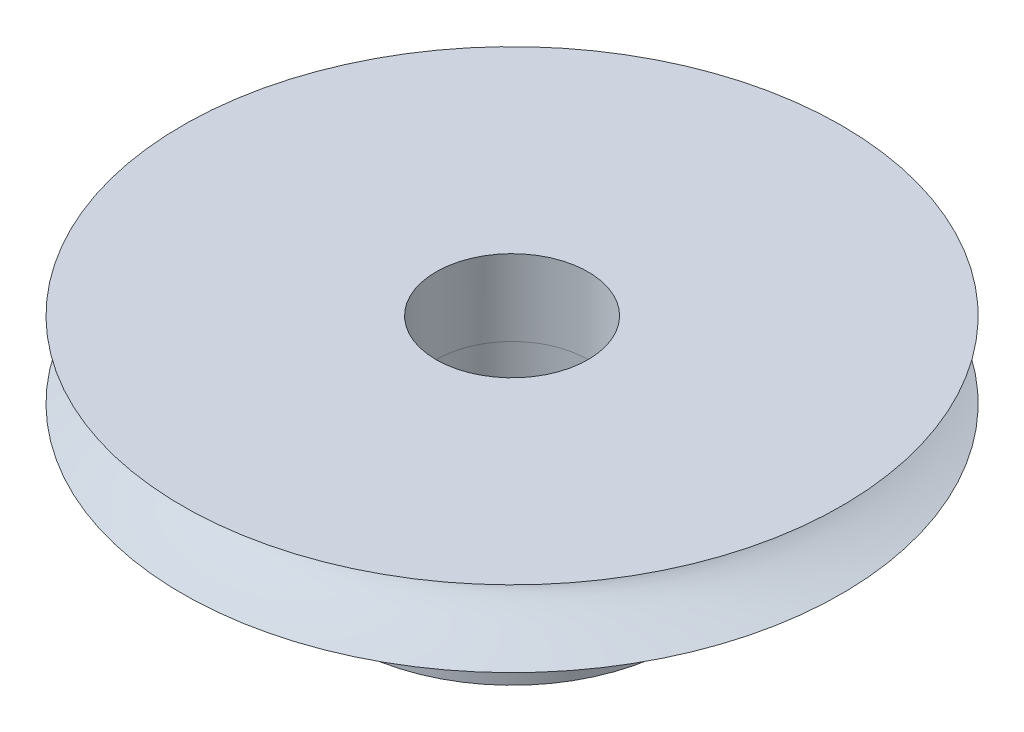
ISO-10303-21;
HEADER;
FILE_DESCRIPTION(('STEP AP214'),'2;1');
FILE_NAME('part.step','',(''),(''),'','','');
FILE_SCHEMA(('AUTOMOTIVE_DESIGN { 1 0 10303 214 1 1 1 1 }'));
ENDSEC;
DATA;
#1=APPLICATION_CONTEXT('core data for automotive mechanical design processes');
#2=APPLICATION_PROTOCOL_DEFINITION('international standard','automotive_design',2000,#1);
#3=PRODUCT_CONTEXT('',#1,'mechanical');
#4=PRODUCT('Part','Part','',(#3));
#5=PRODUCT_RELATED_PRODUCT_CATEGORY('part','',(#4));
#6=PRODUCT_DEFINITION_FORMATION('','',#4);
#7=PRODUCT_DEFINITION_CONTEXT('part definition',#1,'design');
#8=PRODUCT_DEFINITION('design','',#6,#7);
#9=PRODUCT_DEFINITION_SHAPE('','',#8);
#10=(LENGTH_UNIT() NAMED_UNIT(*) SI_UNIT(.MILLI.,.METRE.));
#11=(NAMED_UNIT(*) PLANE_ANGLE_UNIT() SI_UNIT($,.RADIAN.));
#12=(NAMED_UNIT(*) SI_UNIT($,.STERADIAN.) SOLID_ANGLE_UNIT());
#13=UNCERTAINTY_MEASURE_WITH_UNIT(LENGTH_MEASURE(1.E-05),#10,'distance_accuracy_value','');
#14=(GEOMETRIC_REPRESENTATION_CONTEXT(3) GLOBAL_UNCERTAINTY_ASSIGNED_CONTEXT((#13)) GLOBAL_UNIT_ASSIGNED_CONTEXT((#10,
#11,#12)) REPRESENTATION_CONTEXT('',''));
#15=CARTESIAN_POINT('',(0.,0.,0.));
#16=DIRECTION('',(0.,0.,1.));
#17=DIRECTION('',(1.,0.,0.));
#18=AXIS2_PLACEMENT_3D('',#15,#16,#17);
#19=CARTESIAN_POINT('',(-4.7030891410279,0.0646365379077759,0.));
#20=CARTESIAN_POINT('',(0.132127884853617,-1.29416630680979,0.));
#21=CARTESIAN_POINT('',(-4.7030891410279,-2.93536346209222,0.));
#22=B_SPLINE_CURVE_WITH_KNOTS('',2,(#19,#20,#21),.UNSPECIFIED.,.F.,.F.,(3,3),(0.,1.),.UNSPECIFIED.);
#23=CARTESIAN_POINT('',(8.2969108589721,-2.93536346209222,0.));
#24=DIRECTION('',(0.,-1.,0.));
#25=AXIS1_PLACEMENT('',#23,#24);
#26=SURFACE_OF_REVOLUTION('',#22,#25);
#27=CARTESIAN_POINT('',(8.2969108589721,-2.93536346209222,0.));
#28=DIRECTION('',(0.,-1.,0.));
#29=DIRECTION('',(0.,0.,-1.));
#30=AXIS2_PLACEMENT_3D('',#27,#28,#29);
#31=CIRCLE('',#30,13.);
#32=CARTESIAN_POINT('',(8.2969108589721,-2.93536346209222,-13.));
#33=VERTEX_POINT('',#32);
#34=EDGE_CURVE('E83',#33,#33,#31,.T.);
#35=ORIENTED_EDGE('',*,*,#34,.F.);
#36=EDGE_LOOP('',(#35));
#37=FACE_BOUND('',#36,.T.);
#38=CARTESIAN_POINT('',(8.2969108589721,0.0646365379077759,0.));
#39=DIRECTION('',(0.,-1.,0.));
#40=DIRECTION('',(0.,0.,-1.));
#41=AXIS2_PLACEMENT_3D('',#38,#39,#40);
#42=CIRCLE('',#41,13.);
#43=CARTESIAN_POINT('',(8.2969108589721,0.0646365379077759,-13.));
#44=VERTEX_POINT('',#43);
#45=EDGE_CURVE('E72',#44,#44,#42,.T.);
#46=ORIENTED_EDGE('',*,*,#45,.T.);
#47=EDGE_LOOP('',(#46));
#48=FACE_BOUND('',#47,.T.);
#49=ADVANCED_FACE('F36',(#37,#48),#26,.T.);
#50=CARTESIAN_POINT('',(-4.7030891410279,-2.93536346209222,0.));
#51=DIRECTION('',(0.,1.,0.));
#52=DIRECTION('',(0.,0.,1.));
#53=AXIS2_PLACEMENT_3D('',#50,#51,#52);
#54=PLANE('',#53);
#55=CARTESIAN_POINT('',(8.29691086,-2.93536346209222,0.));
#56=DIRECTION('',(0.,1.,0.));
#57=DIRECTION('',(0.,0.,1.));
#58=AXIS2_PLACEMENT_3D('',#55,#56,#57);
#59=CIRCLE('',#58,6.53976727896577);
#60=CARTESIAN_POINT('',(8.29691086,-2.93536346209222,6.53976727896577));
#61=VERTEX_POINT('',#60);
#62=EDGE_CURVE('E48',#61,#61,#59,.F.);
#63=ORIENTED_EDGE('',*,*,#62,.F.);
#64=EDGE_LOOP('',(#63));
#65=FACE_BOUND('',#64,.T.);
#66=ORIENTED_EDGE('',*,*,#34,.T.);
#67=EDGE_LOOP('',(#66));
#68=FACE_BOUND('',#67,.T.);
#69=ADVANCED_FACE('F124',(#65,#68),#54,.F.);
#70=CARTESIAN_POINT('',(-4.7030891410279,0.0646365379077759,0.));
#71=DIRECTION('',(0.,1.,0.));
#72=DIRECTION('',(0.,0.,1.));
#73=AXIS2_PLACEMENT_3D('',#70,#71,#72);
#74=PLANE('',#73);
#75=CARTESIAN_POINT('',(8.29691086,0.0646365379077759,0.));
#76=DIRECTION('',(0.,1.,0.));
#77=DIRECTION('',(0.,0.,1.));
#78=AXIS2_PLACEMENT_3D('',#75,#76,#77);
#79=CIRCLE('',#78,3.);
#80=CARTESIAN_POINT('',(8.29691086,0.0646365379077759,3.));
#81=VERTEX_POINT('',#80);
#82=EDGE_CURVE('E70',#81,#81,#79,.T.);
#83=ORIENTED_EDGE('',*,*,#82,.F.);
#84=EDGE_LOOP('',(#83));
#85=FACE_BOUND('',#84,.T.);
#86=ORIENTED_EDGE('',*,*,#45,.F.);
#87=EDGE_LOOP('',(#86));
#88=FACE_BOUND('',#87,.T.);
#89=ADVANCED_FACE('F129',(#85,#88),#74,.T.);
#90=CARTESIAN_POINT('',(8.29691086,-2.93536346209222,0.));
#91=DIRECTION('',(0.,1.,0.));
#92=DIRECTION('',(0.,0.,1.));
#93=AXIS2_PLACEMENT_3D('',#90,#91,#92);
#94=CYLINDRICAL_SURFACE('',#93,3.);
#95=CARTESIAN_POINT('',(8.29691086,-2.93536346209222,0.));
#96=DIRECTION('',(0.,1.,0.));
#97=DIRECTION('',(0.,0.,1.));
#98=AXIS2_PLACEMENT_3D('',#95,#96,#97);
#99=CIRCLE('',#98,3.);
#100=CARTESIAN_POINT('',(5.29691086,-2.93536346209222,0.));
#101=VERTEX_POINT('',#100);
#102=EDGE_CURVE('E56',#101,#101,#99,.T.);
#103=ORIENTED_EDGE('',*,*,#102,.F.);
#104=EDGE_LOOP('',(#103));
#105=FACE_BOUND('',#104,.T.);
#106=ORIENTED_EDGE('',*,*,#82,.T.);
#107=EDGE_LOOP('',(#106));
#108=FACE_BOUND('',#107,.T.);
#109=ADVANCED_FACE('F120',(#105,#108),#94,.F.);
#110=CARTESIAN_POINT('',(8.29691086,-7.93536346209222,0.));
#111=DIRECTION('',(0.,1.,0.));
#112=DIRECTION('',(0.,0.,1.));
#113=AXIS2_PLACEMENT_3D('',#110,#111,#112);
#114=CYLINDRICAL_SURFACE('',#113,6.53976727896577);
#115=CARTESIAN_POINT('',(14.6232276632152,-5.43164949076936,1.65718790980036));
#116=CARTESIAN_POINT('',(14.6232285423907,-5.38689388208723,1.65718610338816));
#117=CARTESIAN_POINT('',(14.6241932172446,-5.34211011048688,1.65351536227793));
#118=CARTESIAN_POINT('',(14.6279879225404,-5.25378835530042,1.63892462455044));
#119=CARTESIAN_POINT('',(14.6308199146819,-5.21025173214282,1.62799700417297));
#120=CARTESIAN_POINT('',(14.6381507130368,-5.1257158485961,1.59920370558382));
#121=CARTESIAN_POINT('',(14.642648402077,-5.08471490899901,1.58134267718221));
#122=CARTESIAN_POINT('',(14.6530073040293,-5.0063739620068,1.53917613265695));
#123=CARTESIAN_POINT('',(14.6588682794177,-4.96903331849192,1.51487173904977));
#124=CARTESIAN_POINT('',(14.6716068562294,-4.89886477627407,1.46033985308055));
#125=CARTESIAN_POINT('',(14.6784891935206,-4.86605935393636,1.43008454254686));
#126=CARTESIAN_POINT('',(14.6928249730675,-4.80608656379418,1.36453726206844));
#127=CARTESIAN_POINT('',(14.7002784434357,-4.77891947376611,1.32924504412141));
#128=CARTESIAN_POINT('',(14.7153491757765,-4.73091419341167,1.2544572869117));
#129=CARTESIAN_POINT('',(14.72296688137,-4.71009629970239,1.21494880164004));
#130=CARTESIAN_POINT('',(14.7379360486431,-4.67551033759991,1.13291094451407));
#131=CARTESIAN_POINT('',(14.7452875197957,-4.66174201814593,1.09038168030203));
#132=CARTESIAN_POINT('',(14.7593425038368,-4.64171306797088,1.00371794896085));
#133=CARTESIAN_POINT('',(14.7660490831124,-4.63541510978355,0.959592607799138));
#134=CARTESIAN_POINT('',(14.7785994402972,-4.63038999645085,0.870792422805709));
#135=CARTESIAN_POINT('',(14.7844432507854,-4.63166255535966,0.826117599792069));
#136=CARTESIAN_POINT('',(14.7950849286729,-4.64171239317647,0.737740465696337));
#137=CARTESIAN_POINT('',(14.7998882190077,-4.65044952818574,0.694034233195488));
#138=CARTESIAN_POINT('',(14.8084401951434,-4.67511777493138,0.608593787501458));
#139=CARTESIAN_POINT('',(14.8121888616132,-4.69104901852023,0.566859610467281));
#140=CARTESIAN_POINT('',(14.818686810666,-4.72969609794835,0.486444010430453));
#141=CARTESIAN_POINT('',(14.8214334868195,-4.75242935216511,0.44777075117003));
#142=CARTESIAN_POINT('',(14.8260382059198,-4.8040224711038,0.374693012350333));
#143=CARTESIAN_POINT('',(14.8278962098182,-4.83288260496094,0.340288720419042));
#144=CARTESIAN_POINT('',(14.830908169946,-4.89613519918013,0.276519536058027));
#145=CARTESIAN_POINT('',(14.8320574378078,-4.93056263788654,0.247189106186187));
#146=CARTESIAN_POINT('',(14.8338320988496,-5.00385228459629,0.194701435202917));
#147=CARTESIAN_POINT('',(14.8344574905101,-5.04271450546203,0.171544211996561));
#148=CARTESIAN_POINT('',(14.835374044976,-5.12380105148705,0.132086417340071));
#149=CARTESIAN_POINT('',(14.8356650753751,-5.16602670148361,0.115788563802393));
#150=CARTESIAN_POINT('',(14.8360633118534,-5.25262571324516,0.0905641895641914));
#151=CARTESIAN_POINT('',(14.8361705264048,-5.29699897592803,0.0816373291385821));
#152=CARTESIAN_POINT('',(14.8362896290041,-5.38632666118881,0.0714669594083169));
#153=CARTESIAN_POINT('',(14.8363021284823,-5.43127547653657,0.0701741805181361));
#154=CARTESIAN_POINT('',(14.8362464508406,-5.52074740301057,0.0751805424654309));
#155=CARTESIAN_POINT('',(14.8361782753658,-5.56527052279879,0.0814795284940992));
#156=CARTESIAN_POINT('',(14.8358988536232,-5.65248110194662,0.10144044943636));
#157=CARTESIAN_POINT('',(14.8356880686569,-5.69517400949202,0.115078615158611));
#158=CARTESIAN_POINT('',(14.8349962093295,-5.77768258333974,0.149288353446227));
#159=CARTESIAN_POINT('',(14.8345151258527,-5.81749815255307,0.169860159838414));
#160=CARTESIAN_POINT('',(14.8331054192907,-5.89334332008084,0.217449179952169));
#161=CARTESIAN_POINT('',(14.8321745429946,-5.9293527327057,0.244498494502588));
#162=CARTESIAN_POINT('',(14.8296675182739,-5.99635760013778,0.304198701990065));
#163=CARTESIAN_POINT('',(14.8280913458281,-6.02735286823351,0.336849803427388));
#164=CARTESIAN_POINT('',(14.8240954174176,-6.08362105686695,0.407009497784259));
#165=CARTESIAN_POINT('',(14.8216711099469,-6.10886186416613,0.444543598526803));
#166=CARTESIAN_POINT('',(14.8158312504636,-6.15268257787918,0.523247496623109));
#167=CARTESIAN_POINT('',(14.8124157177072,-6.17126261367381,0.564417223338058));
#168=CARTESIAN_POINT('',(14.804524556844,-6.20118117293371,0.649093133566165));
#169=CARTESIAN_POINT('',(14.8000517012225,-6.21253835331013,0.692592980196058));
#170=CARTESIAN_POINT('',(14.7900553801637,-6.22774953022037,0.780767484098668));
#171=CARTESIAN_POINT('',(14.7845319600101,-6.2316038500773,0.825442090662999));
#172=CARTESIAN_POINT('',(14.7725932641062,-6.23169403092554,0.914381634596473));
#173=CARTESIAN_POINT('',(14.7661840440878,-6.22797944776823,0.958647342789999));
#174=CARTESIAN_POINT('',(14.7526669105414,-6.21314210098296,1.04580857745071));
#175=CARTESIAN_POINT('',(14.7455589973586,-6.20201934101534,1.08870410459488));
#176=CARTESIAN_POINT('',(14.7309572839263,-6.17269672960967,1.17191640578135));
#177=CARTESIAN_POINT('',(14.723463608032,-6.15449914658373,1.21223400156988));
#178=CARTESIAN_POINT('',(14.7084659455005,-6.11154858667805,1.2892078841463));
#179=CARTESIAN_POINT('',(14.7009619587625,-6.08679554525455,1.32586413488042));
#180=CARTESIAN_POINT('',(14.6863141325435,-6.03125302080083,1.39475152648839));
#181=CARTESIAN_POINT('',(14.6791728472817,-6.00042664862577,1.4269534691128));
#182=CARTESIAN_POINT('',(14.6657308394642,-5.9336888633646,1.48580002728916));
#183=CARTESIAN_POINT('',(14.6594303166723,-5.89777624595848,1.51244332296023));
#184=CARTESIAN_POINT('',(14.6480534605966,-5.82173354753015,1.55953020684399));
#185=CARTESIAN_POINT('',(14.6429817445171,-5.78158834903103,1.57995048409934));
#186=CARTESIAN_POINT('',(14.6344397952977,-5.69835031402823,1.61387478872132));
#187=CARTESIAN_POINT('',(14.6309678131482,-5.65526075612353,1.62738637123598));
#188=CARTESIAN_POINT('',(14.626702664487,-5.58189625962208,1.64387832601437));
#189=CARTESIAN_POINT('',(14.6254035894691,-5.55208487697699,1.64886257883413));
#190=CARTESIAN_POINT('',(14.6236657951211,-5.49206977036485,1.65551796868654));
#191=CARTESIAN_POINT('',(14.6232270696436,-5.46186604920267,1.65718912939186));
#192=CARTESIAN_POINT('',(14.6232276632152,-5.43164949076936,1.65718790980036));
#193=B_SPLINE_CURVE_WITH_KNOTS('',3,(#115,#116,#117,#118,#119,#120,#121,#122,#123,#124,#125,
#126,#127,#128,#129,#130,#131,#132,#133,#134,#135,#136,#137,#138,#139,#140,#141,#142,#143,#144,
#145,#146,#147,#148,#149,#150,#151,#152,#153,#154,#155,#156,#157,#158,#159,#160,#161,#162,#163,
#164,#165,#166,#167,#168,#169,#170,#171,#172,#173,#174,#175,#176,#177,#178,#179,#180,#181,#182,
#183,#184,#185,#186,#187,#188,#189,#190,#191,#192),.UNSPECIFIED.,.T.,.F.,(4,2,2,2,2,2,2,2,2,2,2,
2,2,2,2,2,2,2,2,2,2,2,2,2,2,2,2,2,2,2,2,2,2,2,2,2,2,2,4),(0.,0.134156444816222,
0.268454051962342,0.402661749135058,0.536846080960288,0.671673254094057,0.806507068006988,
0.941767496346315,1.07702310723883,1.21159999492362,1.34617179953998,1.48002441067543,
1.6138794751396,1.74808028857725,1.8822869982689,2.01737223537042,2.15245786427561,
2.28759696836332,2.42272984361512,2.55698962354853,2.69124666574639,2.82507148757523,
2.95890082290074,3.09340763033806,3.22791944524748,3.36316447844813,3.49840688446776,
3.63329851994902,3.76818434237438,3.90218986536058,4.0361953221355,4.17015784790922,
4.3041216927006,4.43892581295428,4.57376190562698,4.70909704556757,4.84428386868606,
4.93485966775244,5.02543481963532),.UNSPECIFIED.);
#194=CARTESIAN_POINT('',(14.6232276632152,-5.43164949076936,1.65718790980036));
#195=VERTEX_POINT('',#194);
#196=EDGE_CURVE('E40',#195,#195,#193,.T.);
#197=ORIENTED_EDGE('',*,*,#196,.T.);
#198=EDGE_LOOP('',(#197));
#199=FACE_BOUND('',#198,.T.);
#200=CARTESIAN_POINT('',(1.75753376509114,-5.43164949076936,-0.0714372004820922));
#201=CARTESIAN_POINT('',(1.75753339390409,-5.47640509945149,-0.0714391748920874));
#202=CARTESIAN_POINT('',(1.7575718359038,-5.52118887105184,-0.0752343639631053));
#203=CARTESIAN_POINT('',(1.75776298493084,-5.6095106262383,-0.090309272843873));
#204=CARTESIAN_POINT('',(1.75791581214776,-5.6530472493959,-0.101596863837775));
#205=CARTESIAN_POINT('',(1.75844509020798,-5.73758313294262,-0.131304009659915));
#206=CARTESIAN_POINT('',(1.75882139127056,-5.77858407253971,-0.149718784699975));
#207=CARTESIAN_POINT('',(1.75995987158675,-5.85692501953192,-0.193124178252256));
#208=CARTESIAN_POINT('',(1.76072198364819,-5.8942656630468,-0.218113651362388));
#209=CARTESIAN_POINT('',(1.76282905875174,-5.96443420526465,-0.274073978032768));
#210=CARTESIAN_POINT('',(1.76417679658596,-5.99723962760236,-0.305072913253345));
#211=CARTESIAN_POINT('',(1.76765086529169,-6.05721241774454,-0.372079565161665));
#212=CARTESIAN_POINT('',(1.76977723450876,-6.08437950777261,-0.408087528476787));
#213=CARTESIAN_POINT('',(1.77498147160936,-6.13238478812706,-0.484200940684797));
#214=CARTESIAN_POINT('',(1.77806232874947,-6.15320268183633,-0.524318993556941));
#215=CARTESIAN_POINT('',(1.78527821836391,-6.18778864393881,-0.607398575330946));
#216=CARTESIAN_POINT('',(1.78941321328874,-6.20155696339279,-0.650360002908436));
#217=CARTESIAN_POINT('',(1.79873188078588,-6.22158591356784,-0.737660102235137));
#218=CARTESIAN_POINT('',(1.80391018688819,-6.22788387175517,-0.781990781049342));
#219=CARTESIAN_POINT('',(1.81524404471924,-6.23290898508787,-0.870954413995605));
#220=CARTESIAN_POINT('',(1.8213995595293,-6.23163642617906,-0.915587356647258));
#221=CARTESIAN_POINT('',(1.83446274033532,-6.22158658836225,-1.00363913940301));
#222=CARTESIAN_POINT('',(1.84136621079027,-6.21284945335298,-1.04706319325725));
#223=CARTESIAN_POINT('',(1.85566983366377,-6.18818120660734,-1.13173085195236));
#224=CARTESIAN_POINT('',(1.86306999518348,-6.17224996301849,-1.1729744168141));
#225=CARTESIAN_POINT('',(1.87802847418032,-6.13360288359037,-1.25225326630926));
#226=CARTESIAN_POINT('',(1.88558715080243,-6.11086962937361,-1.29027998874807));
#227=CARTESIAN_POINT('',(1.90043486279376,-6.05927651043492,-1.36198148662375));
#228=CARTESIAN_POINT('',(1.9077238863014,-6.03041637657778,-1.39565607077983));
#229=CARTESIAN_POINT('',(1.92165084496759,-5.9671637823586,-1.4579587240154));
#230=CARTESIAN_POINT('',(1.92828420570907,-5.93273634365218,-1.48655231522669));
#231=CARTESIAN_POINT('',(1.94042678795012,-5.85944669694243,-1.53764695999089));
#232=CARTESIAN_POINT('',(1.94593600618917,-5.8205844760767,-1.56014799587266));
#233=CARTESIAN_POINT('',(1.95546698084669,-5.73949793005167,-1.59844836340772));
#234=CARTESIAN_POINT('',(1.95948814757316,-5.69727228005511,-1.61424503858912));
#235=CARTESIAN_POINT('',(1.96576209682292,-5.61067326829357,-1.63867995640795));
#236=CARTESIAN_POINT('',(1.96801496084608,-5.5663000056107,-1.64731852895852));
#237=CARTESIAN_POINT('',(1.97058458708726,-5.47697232034991,-1.65715964814589));
#238=CARTESIAN_POINT('',(1.97091376443987,-5.43202350500215,-1.65840987843123));
#239=CARTESIAN_POINT('',(1.96964602062585,-5.34255157852815,-1.6535663687978));
#240=CARTESIAN_POINT('',(1.96804913873479,-5.29802845873993,-1.64747277863184));
#241=CARTESIAN_POINT('',(1.96304989550388,-5.2108178795921,-1.62814600941162));
#242=CARTESIAN_POINT('',(1.95965336318417,-5.1681249720467,-1.614935878346));
#243=CARTESIAN_POINT('',(1.95129090507569,-5.08561639819898,-1.58175675603362));
#244=CARTESIAN_POINT('',(1.94632492635999,-5.04580082898565,-1.56178753684647));
#245=CARTESIAN_POINT('',(1.93512334875583,-4.96995566145788,-1.515514145279));
#246=CARTESIAN_POINT('',(1.92888145004226,-4.93394624883302,-1.48917841576992));
#247=CARTESIAN_POINT('',(1.9155414840795,-4.86694138140094,-1.43093371425029));
#248=CARTESIAN_POINT('',(1.9084433849652,-4.83594611330521,-1.39902453479339));
#249=CARTESIAN_POINT('',(1.89377870091691,-4.77967792467177,-1.33029828654808));
#250=CARTESIAN_POINT('',(1.8862097731917,-4.75443711737259,-1.29345541317541));
#251=CARTESIAN_POINT('',(1.87106835326513,-4.71061640365954,-1.21600126585621));
#252=CARTESIAN_POINT('',(1.86349586113587,-4.69203636786491,-1.17539006512604));
#253=CARTESIAN_POINT('',(1.84875666036845,-4.66211780860501,-1.09163425247125));
#254=CARTESIAN_POINT('',(1.84158895021275,-4.6507606282286,-1.04849648450211));
#255=CARTESIAN_POINT('',(1.82795678485292,-4.63554945131835,-0.96081048994891));
#256=CARTESIAN_POINT('',(1.82149229935585,-4.63169513146142,-0.916262324227641));
#257=CARTESIAN_POINT('',(1.80953168828338,-4.63160495061318,-0.827325724800008));
#258=CARTESIAN_POINT('',(1.80402951827851,-4.63531953377049,-0.782938146037969));
#259=CARTESIAN_POINT('',(1.79406075718562,-4.65015688055576,-0.695300154680545));
#260=CARTESIAN_POINT('',(1.78959416558592,-4.66127964052338,-0.652049741523305));
#261=CARTESIAN_POINT('',(1.78171385508749,-4.69060225192905,-0.567934357613135));
#262=CARTESIAN_POINT('',(1.77829979934093,-4.70879983495499,-0.527068627080866));
#263=CARTESIAN_POINT('',(1.77244804833165,-4.75175039486067,-0.448865906601185));
#264=CARTESIAN_POINT('',(1.77001036268266,-4.77650343628417,-0.41152895140231));
#265=CARTESIAN_POINT('',(1.76595563994075,-4.83204596073789,-0.341218278251094));
#266=CARTESIAN_POINT('',(1.76434384619378,-4.86287233291295,-0.308273397239116));
#267=CARTESIAN_POINT('',(1.76177638226976,-4.92961011817412,-0.24796574339345));
#268=CARTESIAN_POINT('',(1.76082086780073,-4.96552273558024,-0.220604296359939));
#269=CARTESIAN_POINT('',(1.75936549936706,-5.04156543400857,-0.172184368739466));
#270=CARTESIAN_POINT('',(1.75886734495484,-5.08171063250768,-0.151149591123377));
#271=CARTESIAN_POINT('',(1.75815191766239,-5.16494866751048,-0.116173720807695));
#272=CARTESIAN_POINT('',(1.75793433755607,-5.20803822541519,-0.102224879243078));
#273=CARTESIAN_POINT('',(1.7576951148712,-5.28140272191664,-0.0851920040300962));
#274=CARTESIAN_POINT('',(1.75763250762501,-5.31121410456173,-0.0800416203156364));
#275=CARTESIAN_POINT('',(1.75755195819723,-5.37122921117388,-0.0731635642622601));
#276=CARTESIAN_POINT('',(1.7575340156965,-5.40143293233605,-0.0714358674675998));
#277=CARTESIAN_POINT('',(1.75753376509114,-5.43164949076936,-0.0714372004820922));
#278=B_SPLINE_CURVE_WITH_KNOTS('',3,(#200,#201,#202,#203,#204,#205,#206,#207,#208,#209,#210,
#211,#212,#213,#214,#215,#216,#217,#218,#219,#220,#221,#222,#223,#224,#225,#226,#227,#228,#229,
#230,#231,#232,#233,#234,#235,#236,#237,#238,#239,#240,#241,#242,#243,#244,#245,#246,#247,#248,
#249,#250,#251,#252,#253,#254,#255,#256,#257,#258,#259,#260,#261,#262,#263,#264,#265,#266,#267,
#268,#269,#270,#271,#272,#273,#274,#275,#276,#277),.UNSPECIFIED.,.T.,.F.,(4,2,2,2,2,2,2,2,2,2,2,
2,2,2,2,2,2,2,2,2,2,2,2,2,2,2,2,2,2,2,2,2,2,2,2,2,2,2,4),(0.,0.134156444816222,
0.268454051962342,0.402661749135058,0.536846080960288,0.671673254094056,0.806507068006987,
0.941767496346315,1.07702310723883,1.21159999492362,1.34617179953998,1.48002441067543,
1.6138794751396,1.74808028857725,1.8822869982689,2.01737223537042,2.15245786427561,
2.28759696836332,2.42272984361512,2.55698962354853,2.69124666574639,2.82507148757523,
2.95890082290074,3.09340763033806,3.22791944524748,3.36316447844813,3.49840688446776,
3.63329851994902,3.76818434237438,3.90218986536058,4.0361953221355,4.17015784790922,
4.30412169270059,4.43892581295428,4.57376190562698,4.70909704556756,4.84428386868606,
4.93485966775244,5.02543481963532),.UNSPECIFIED.);
#279=CARTESIAN_POINT('',(1.75753376509114,-5.43164949076936,-0.0714372004820922));
#280=VERTEX_POINT('',#279);
#281=EDGE_CURVE('E11',#280,#280,#278,.T.);
#282=ORIENTED_EDGE('',*,*,#281,.T.);
#283=EDGE_LOOP('',(#282));
#284=FACE_BOUND('',#283,.T.);
#285=CARTESIAN_POINT('',(8.29691086,-7.93536346209222,0.));
#286=DIRECTION('',(0.,-1.,0.));
#287=DIRECTION('',(0.,0.,-1.));
#288=AXIS2_PLACEMENT_3D('',#285,#286,#287);
#289=CIRCLE('',#288,6.53976727896577);
#290=CARTESIAN_POINT('',(8.29691086,-7.93536346209222,-6.53976727896577));
#291=VERTEX_POINT('',#290);
#292=EDGE_CURVE('E62',#291,#291,#289,.T.);
#293=ORIENTED_EDGE('',*,*,#292,.F.);
#294=EDGE_LOOP('',(#293));
#295=FACE_BOUND('',#294,.T.);
#296=ORIENTED_EDGE('',*,*,#62,.T.);
#297=EDGE_LOOP('',(#296));
#298=FACE_BOUND('',#297,.T.);
#299=ADVANCED_FACE('F89',(#199,#284,#295,#298),#114,.T.);
#300=CARTESIAN_POINT('',(8.29691086,-7.93536346209222,0.));
#301=DIRECTION('',(0.,-1.,0.));
#302=DIRECTION('',(0.,0.,-1.));
#303=AXIS2_PLACEMENT_3D('',#300,#301,#302);
#304=PLANE('',#303);
#305=CARTESIAN_POINT('',(8.33295715963622,-7.93536346209222,0.));
#306=DIRECTION('',(0.,1.,0.));
#307=DIRECTION('',(0.,0.,1.));
#308=AXIS2_PLACEMENT_3D('',#305,#306,#307);
#309=CIRCLE('',#308,3.03604629963622);
#310=CARTESIAN_POINT('',(8.33295715963622,-7.93536346209222,3.03604629963622));
#311=VERTEX_POINT('',#310);
#312=EDGE_CURVE('E58',#311,#311,#309,.T.);
#313=ORIENTED_EDGE('',*,*,#312,.T.);
#314=EDGE_LOOP('',(#313));
#315=FACE_BOUND('',#314,.T.);
#316=ORIENTED_EDGE('',*,*,#292,.T.);
#317=EDGE_LOOP('',(#316));
#318=FACE_BOUND('',#317,.T.);
#319=ADVANCED_FACE('F112',(#315,#318),#304,.T.);
#320=CARTESIAN_POINT('',(8.33295715963622,-7.93536346209222,0.));
#321=DIRECTION('',(0.,1.,0.));
#322=DIRECTION('',(0.,0.,1.));
#323=AXIS2_PLACEMENT_3D('',#320,#321,#322);
#324=CYLINDRICAL_SURFACE('',#323,3.03604629963622);
#325=CARTESIAN_POINT('',(11.1271513854245,-5.43164949076936,1.18745768855415));
#326=CARTESIAN_POINT('',(11.127152309663,-5.47572827349108,1.1874567002764));
#327=CARTESIAN_POINT('',(11.1286415742665,-5.5198188155438,1.18396961262573));
#328=CARTESIAN_POINT('',(11.1344625677126,-5.60672758635231,1.17012780231858));
#329=CARTESIAN_POINT('',(11.1387957681645,-5.64954514439908,1.15976952409932));
#330=CARTESIAN_POINT('',(11.1499056896066,-5.7326377980739,1.13251608950444));
#331=CARTESIAN_POINT('',(11.1566789983855,-5.77291635224591,1.11563005904317));
#332=CARTESIAN_POINT('',(11.1720994898839,-5.84994847641541,1.07577997508151));
#333=CARTESIAN_POINT('',(11.1807468076178,-5.88670179215899,1.05281548362727));
#334=CARTESIAN_POINT('',(11.1994476228411,-5.95654796147817,1.00079393139586));
#335=CARTESIAN_POINT('',(11.2095281828102,-5.98954088426522,0.971612402019973));
#336=CARTESIAN_POINT('',(11.2301805519691,-6.05004717110189,0.908176570597557));
#337=CARTESIAN_POINT('',(11.2407524120683,-6.07755996572252,0.873921742038919));
#338=CARTESIAN_POINT('',(11.2618042600932,-6.1267466083819,0.800567693862461));
#339=CARTESIAN_POINT('',(11.2722800712872,-6.1483199840529,0.761399729906443));
#340=CARTESIAN_POINT('',(11.2922423739491,-6.18436169763989,0.679686912808865));
#341=CARTESIAN_POINT('',(11.3017290271325,-6.19883119839373,0.637142613667108));
#342=CARTESIAN_POINT('',(11.3189292227043,-6.21993441064326,0.55085329095033));
#343=CARTESIAN_POINT('',(11.3266776258958,-6.2267358673949,0.507156287759459));
#344=CARTESIAN_POINT('',(11.3402887248185,-6.2328358853779,0.418955503829959));
#345=CARTESIAN_POINT('',(11.3461517326075,-6.23213568889086,0.374451857890764));
#346=CARTESIAN_POINT('',(11.3557118872382,-6.22337088545738,0.287080998021992));
#347=CARTESIAN_POINT('',(11.3594593730767,-6.21549026093456,0.244200643338408));
#348=CARTESIAN_POINT('',(11.3650688524295,-6.19288380002708,0.160158194417335));
#349=CARTESIAN_POINT('',(11.3669307432251,-6.17815759079025,0.118996193904964));
#350=CARTESIAN_POINT('',(11.3690165402118,-6.14214348558359,0.0391446224948176));
#351=CARTESIAN_POINT('',(11.3692248832816,-6.1207952051462,0.000481932516067441));
#352=CARTESIAN_POINT('',(11.3683499786866,-6.0721891702916,-0.0729166581368415));
#353=CARTESIAN_POINT('',(11.3672664860322,-6.04493029576426,-0.107651812607159));
#354=CARTESIAN_POINT('',(11.364239889403,-5.98431565418134,-0.173244194719558));
#355=CARTESIAN_POINT('',(11.3622720892371,-5.95080217073004,-0.203954699896976));
#356=CARTESIAN_POINT('',(11.3580337643043,-5.87913002588671,-0.259350474510941));
#357=CARTESIAN_POINT('',(11.3557632216918,-5.84097109067246,-0.284035388516141));
#358=CARTESIAN_POINT('',(11.3514481007048,-5.76076465618594,-0.326733878925921));
#359=CARTESIAN_POINT('',(11.3494049907042,-5.71869478231129,-0.344705690343094));
#360=CARTESIAN_POINT('',(11.3460230880388,-5.63205916875437,-0.373119054122296));
#361=CARTESIAN_POINT('',(11.3446841278893,-5.5874940253738,-0.383562397376833));
#362=CARTESIAN_POINT('',(11.3430303050189,-5.49850793783274,-0.396329865097672));
#363=CARTESIAN_POINT('',(11.3426870658958,-5.45411978689824,-0.398879105235455));
#364=CARTESIAN_POINT('',(11.3430148950371,-5.36556296484118,-0.396397760798423));
#365=CARTESIAN_POINT('',(11.3436858591916,-5.3213942716578,-0.39136795422701));
#366=CARTESIAN_POINT('',(11.3458808994055,-5.23537377507876,-0.374086104157919));
#367=CARTESIAN_POINT('',(11.3473889876804,-5.19349424498245,-0.361969187401638));
#368=CARTESIAN_POINT('',(11.3509413198446,-5.11230973648524,-0.33104299200573));
#369=CARTESIAN_POINT('',(11.3529856320814,-5.0730050870785,-0.312232860136866));
#370=CARTESIAN_POINT('',(11.3572308243705,-4.9971623073798,-0.26804323707845));
#371=CARTESIAN_POINT('',(11.359434111342,-4.96070090467235,-0.242532393290135));
#372=CARTESIAN_POINT('',(11.3634397571775,-4.89240803505724,-0.185894441389468));
#373=CARTESIAN_POINT('',(11.3652420432349,-4.86057740928705,-0.15476631524493));
#374=CARTESIAN_POINT('',(11.3679573967251,-4.80154341224246,-0.0868129448613497));
#375=CARTESIAN_POINT('',(11.368844417441,-4.77449284915634,-0.0498536443150836));
#376=CARTESIAN_POINT('',(11.3691233649645,-4.72690542914864,0.0280528266017415));
#377=CARTESIAN_POINT('',(11.3685153741044,-4.70636821359814,0.0689997772475236));
#378=CARTESIAN_POINT('',(11.3654185596448,-4.6725808289824,0.153366201203838));
#379=CARTESIAN_POINT('',(11.3629444449431,-4.65927506523413,0.196763895300711));
#380=CARTESIAN_POINT('',(11.355919298918,-4.64016241280187,0.285015928636189));
#381=CARTESIAN_POINT('',(11.3513687140479,-4.6343539131898,0.329869952830807));
#382=CARTESIAN_POINT('',(11.3403676394091,-4.63049820059216,0.418313917577999));
#383=CARTESIAN_POINT('',(11.3339778198977,-4.63222481849649,0.461901687871905));
#384=CARTESIAN_POINT('',(11.3194753134463,-4.64286503312178,0.547894075725762));
#385=CARTESIAN_POINT('',(11.3113626850804,-4.65177838552914,0.590298733455015));
#386=CARTESIAN_POINT('',(11.2938820227354,-4.67641528269175,0.672500979994981));
#387=CARTESIAN_POINT('',(11.2845221070188,-4.69209614476796,0.712313137727288));
#388=CARTESIAN_POINT('',(11.2650562052322,-4.72978255090106,0.788622088312645));
#389=CARTESIAN_POINT('',(11.2549501154482,-4.75178897541119,0.825118418705297));
#390=CARTESIAN_POINT('',(11.234365465797,-4.80217987220313,0.894854618087975));
#391=CARTESIAN_POINT('',(11.2238841171611,-4.83071741650177,0.92798305104186));
#392=CARTESIAN_POINT('',(11.2035557582808,-4.89306897301192,0.989080276278206));
#393=CARTESIAN_POINT('',(11.1937089147967,-4.92688436441564,1.01704771572358));
#394=CARTESIAN_POINT('',(11.1752055881353,-4.99969831068504,1.06768196417391));
#395=CARTESIAN_POINT('',(11.1665788857715,-5.0387918292307,1.09022334766413));
#396=CARTESIAN_POINT('',(11.1515158129675,-5.12051608027196,1.12859739722213));
#397=CARTESIAN_POINT('',(11.1450779703558,-5.16314441124469,1.14443457413278));
#398=CARTESIAN_POINT('',(11.1358339085456,-5.24330277003056,1.16686730322405));
#399=CARTESIAN_POINT('',(11.1325977898904,-5.28047673493322,1.17457243469423));
#400=CARTESIAN_POINT('',(11.1282562461789,-5.3556474429754,1.18486777423568));
#401=CARTESIAN_POINT('',(11.127150588532,-5.3936440958409,1.18745854066221));
#402=CARTESIAN_POINT('',(11.1271513854245,-5.43164949076936,1.18745768855415));
#403=B_SPLINE_CURVE_WITH_KNOTS('',3,(#325,#326,#327,#328,#329,#330,#331,#332,#333,#334,#335,
#336,#337,#338,#339,#340,#341,#342,#343,#344,#345,#346,#347,#348,#349,#350,#351,#352,#353,#354,
#355,#356,#357,#358,#359,#360,#361,#362,#363,#364,#365,#366,#367,#368,#369,#370,#371,#372,#373,
#374,#375,#376,#377,#378,#379,#380,#381,#382,#383,#384,#385,#386,#387,#388,#389,#390,#391,#392,
#393,#394,#395,#396,#397,#398,#399,#400,#401,#402),.UNSPECIFIED.,.T.,.F.,(4,2,2,2,2,2,2,2,2,2,2,
2,2,2,2,2,2,2,2,2,2,2,2,2,2,2,2,2,2,2,2,2,2,2,2,2,2,2,4),(0.,0.13209658960034,0.264261587211539,
0.396242480121077,0.528232884859494,0.663167308844179,0.798115746285094,0.935223478161629,
1.07230875929641,1.20633317410858,1.34033539468093,1.47099780020797,1.60166732323833,
1.7335652607931,1.86548821605999,2.0013494382632,2.13721867257228,2.27391965733258,
2.41058811254996,2.54332152890478,2.67604132085291,2.80630948885938,2.93659426897978,
3.06965319369036,3.2027362572191,3.33951009234528,3.47627639531241,3.61197581894161,
3.74764608014346,3.87927261834255,4.01089468207614,4.14169846660721,4.27252046650344,
4.40679689838988,4.54110847794708,4.67827744991056,4.81535398215969,4.92926210147466,
5.04315778430599),.UNSPECIFIED.);
#404=CARTESIAN_POINT('',(11.1271513854245,-5.43164949076936,1.18745768855415));
#405=VERTEX_POINT('',#404);
#406=EDGE_CURVE('E59',#405,#405,#403,.T.);
#407=ORIENTED_EDGE('',*,*,#406,.T.);
#408=EDGE_LOOP('',(#407));
#409=FACE_BOUND('',#408,.T.);
#410=CARTESIAN_POINT('',(5.32442427455913,-5.43164949076936,0.407807568522833));
#411=CARTESIAN_POINT('',(5.32442364395777,-5.38757070804765,0.407806371337952));
#412=CARTESIAN_POINT('',(5.32390762459595,-5.34348016599492,0.404049855217809));
#413=CARTESIAN_POINT('',(5.32194666494059,-5.25657139518641,0.389162467451345));
#414=CARTESIAN_POINT('',(5.32050124373113,-5.21375383713964,0.378027777902412));
#415=CARTESIAN_POINT('',(5.31697897126712,-5.13066118346482,0.348808372563558));
#416=CARTESIAN_POINT('',(5.31490300239389,-5.09038262929281,0.330733359706271));
#417=CARTESIAN_POINT('',(5.31054796248695,-5.01335050512331,0.288226249980815));
#418=CARTESIAN_POINT('',(5.3082688768265,-4.97659718937973,0.263793695053124));
#419=CARTESIAN_POINT('',(5.30396255048576,-4.90675102006055,0.208680920308694));
#420=CARTESIAN_POINT('',(5.30194206101096,-4.8737580972735,0.177873502885487));
#421=CARTESIAN_POINT('',(5.29876623101243,-4.81325181043683,0.111236132259473));
#422=CARTESIAN_POINT('',(5.29761098035952,-4.7857390158162,0.0754056577793846));
#423=CARTESIAN_POINT('',(5.29666778710136,-4.73655237315682,-0.000903627865387565));
#424=CARTESIAN_POINT('',(5.29690201841191,-4.71497899748582,-0.0414476429147753));
#425=CARTESIAN_POINT('',(5.29921605672607,-4.67893728389883,-0.125531667748675));
#426=CARTESIAN_POINT('',(5.30129556151914,-4.66446778314499,-0.169071185866152));
#427=CARTESIAN_POINT('',(5.30748173467909,-4.64336457089546,-0.256840344482726));
#428=CARTESIAN_POINT('',(5.31154210341758,-4.63656311414382,-0.301032869253205));
#429=CARTESIAN_POINT('',(5.32169462426985,-4.63046309616082,-0.389698345172566));
#430=CARTESIAN_POINT('',(5.32778643981203,-4.63116329264786,-0.43417124867138));
#431=CARTESIAN_POINT('',(5.34162717845853,-4.63992809608134,-0.520966972439843));
#432=CARTESIAN_POINT('',(5.34933101636678,-4.64780872060416,-0.563315754587424));
#433=CARTESIAN_POINT('',(5.36610377537949,-4.67041518151164,-0.645858313515296));
#434=CARTESIAN_POINT('',(5.37517277082054,-4.68514139074847,-0.686051972781473));
#435=CARTESIAN_POINT('',(5.3942380493329,-4.72115549595513,-0.763622193620308));
#436=CARTESIAN_POINT('',(5.40424224827233,-4.74250377639252,-0.800968719654306));
#437=CARTESIAN_POINT('',(5.42445994126843,-4.79110981124712,-0.871533324505455));
#438=CARTESIAN_POINT('',(5.4346734746632,-4.81836868577446,-0.904750618916695));
#439=CARTESIAN_POINT('',(5.45490607455539,-4.87898332735738,-0.967217912598566));
#440=CARTESIAN_POINT('',(5.46491023349221,-4.91249681080869,-0.996319874211354));
#441=CARTESIAN_POINT('',(5.48362015776275,-4.98416895565201,-1.0486323390463));
#442=CARTESIAN_POINT('',(5.49232584649188,-5.02232789086626,-1.07184249473193));
#443=CARTESIAN_POINT('',(5.50775835038456,-5.10253432535278,-1.11188770887805));
#444=CARTESIAN_POINT('',(5.51447272523398,-5.14460419922743,-1.12868287111217));
#445=CARTESIAN_POINT('',(5.5252344975274,-5.23123981278435,-1.15519590119159));
#446=CARTESIAN_POINT('',(5.52928252922858,-5.27580495616492,-1.16491545220798));
#447=CARTESIAN_POINT('',(5.53424771800969,-5.36479104370599,-1.17679359442204));
#448=CARTESIAN_POINT('',(5.53525166520843,-5.40917919464048,-1.17916182760266));
#449=CARTESIAN_POINT('',(5.53428050279201,-5.49773601669754,-1.17685501470995));
#450=CARTESIAN_POINT('',(5.53230569895121,-5.54190470988093,-1.17218069156826));
#451=CARTESIAN_POINT('',(5.52562689976093,-5.62792520645996,-1.156091123994));
#452=CARTESIAN_POINT('',(5.52097399237481,-5.66980473655627,-1.144801994055));
#453=CARTESIAN_POINT('',(5.50938456404013,-5.75098924505348,-1.11591023439335));
#454=CARTESIAN_POINT('',(5.50244775195528,-5.79029389446022,-1.09830679974142));
#455=CARTESIAN_POINT('',(5.48668910705216,-5.86613667415892,-1.05680487744336));
#456=CARTESIAN_POINT('',(5.47783028169412,-5.90259807686637,-1.0327803308806));
#457=CARTESIAN_POINT('',(5.45901690757946,-5.97089094648148,-0.979208325612138));
#458=CARTESIAN_POINT('',(5.44906216033428,-6.00272157225167,-0.949659865760778));
#459=CARTESIAN_POINT('',(5.42850657429706,-6.06175556929626,-0.88483316158934));
#460=CARTESIAN_POINT('',(5.41789547385109,-6.08880613238238,-0.849418740092649));
#461=CARTESIAN_POINT('',(5.39706273167319,-6.13639355239009,-0.774348820179384));
#462=CARTESIAN_POINT('',(5.38684106852587,-6.15693076794058,-0.734693555427062));
#463=CARTESIAN_POINT('',(5.36755924092347,-6.19071815255632,-0.652501737858129));
#464=CARTESIAN_POINT('',(5.35849063791598,-6.20402391630459,-0.609990074329447));
#465=CARTESIAN_POINT('',(5.34197220488939,-6.22313656873685,-0.523013552009538));
#466=CARTESIAN_POINT('',(5.3345220274074,-6.22894506834892,-0.478549114932272));
#467=CARTESIAN_POINT('',(5.32178785730477,-6.23280078094656,-0.390338007608945));
#468=CARTESIAN_POINT('',(5.31644591892076,-6.23107416304223,-0.346609444782289));
#469=CARTESIAN_POINT('',(5.30773610610878,-6.22043394841695,-0.259838754898206));
#470=CARTESIAN_POINT('',(5.30436816458135,-6.21152059600958,-0.216796604556858));
#471=CARTESIAN_POINT('',(5.29953130970592,-6.18688369884697,-0.132895545402943));
#472=CARTESIAN_POINT('',(5.29805072048834,-6.17120283677077,-0.0920247271936905));
#473=CARTESIAN_POINT('',(5.29668425555781,-6.13351643063766,-0.0132839496677057));
#474=CARTESIAN_POINT('',(5.29679860194886,-6.11151000612753,0.0245855909653132));
#475=CARTESIAN_POINT('',(5.29824610976929,-6.06111910933559,0.0972820147199209));
#476=CARTESIAN_POINT('',(5.2996113749993,-6.03258156503695,0.132002149945192));
#477=CARTESIAN_POINT('',(5.3030919689544,-5.9702300085268,0.19629832846354));
#478=CARTESIAN_POINT('',(5.30520749391961,-5.93641461712308,0.22587302288045));
#479=CARTESIAN_POINT('',(5.30968951927086,-5.86360067085368,0.279595566215785));
#480=CARTESIAN_POINT('',(5.31206040151456,-5.82450715230802,0.30361457703459));
#481=CARTESIAN_POINT('',(5.31646030291817,-5.74278290126676,0.344603657402624));
#482=CARTESIAN_POINT('',(5.31848955138672,-5.70015457029403,0.36157846640434));
#483=CARTESIAN_POINT('',(5.32148457838242,-5.61999621150816,0.385655630409453));
#484=CARTESIAN_POINT('',(5.32257213279198,-5.5828222466055,0.393941687392666));
#485=CARTESIAN_POINT('',(5.32404221425642,-5.50765153856333,0.405017872591587));
#486=CARTESIAN_POINT('',(5.32442481827319,-5.46965488569782,0.407808600753794));
#487=CARTESIAN_POINT('',(5.32442427455913,-5.43164949076936,0.407807568522833));
#488=B_SPLINE_CURVE_WITH_KNOTS('',3,(#410,#411,#412,#413,#414,#415,#416,#417,#418,#419,#420,
#421,#422,#423,#424,#425,#426,#427,#428,#429,#430,#431,#432,#433,#434,#435,#436,#437,#438,#439,
#440,#441,#442,#443,#444,#445,#446,#447,#448,#449,#450,#451,#452,#453,#454,#455,#456,#457,#458,
#459,#460,#461,#462,#463,#464,#465,#466,#467,#468,#469,#470,#471,#472,#473,#474,#475,#476,#477,
#478,#479,#480,#481,#482,#483,#484,#485,#486,#487),.UNSPECIFIED.,.T.,.F.,(4,2,2,2,2,2,2,2,2,2,2,
2,2,2,2,2,2,2,2,2,2,2,2,2,2,2,2,2,2,2,2,2,2,2,2,2,2,2,4),(0.,0.13209658960034,0.264261587211539,
0.396242480121078,0.528232884859494,0.66316730884418,0.798115746285094,0.93522347816163,
1.07230875929641,1.20633317410858,1.34033539468093,1.47099780020797,1.60166732323833,
1.7335652607931,1.86548821605999,2.0013494382632,2.13721867257228,2.27391965733258,
2.41058811254996,2.54332152890478,2.67604132085291,2.80630948885938,2.93659426897978,
3.06965319369036,3.2027362572191,3.33951009234528,3.47627639531241,3.61197581894161,
3.74764608014346,3.87927261834255,4.01089468207614,4.14169846660721,4.27252046650344,
4.40679689838988,4.54110847794708,4.67827744991057,4.8153539821597,4.92926210147466,
5.043157784306),.UNSPECIFIED.);
#489=CARTESIAN_POINT('',(5.32442427455913,-5.43164949076936,0.407807568522833));
#490=VERTEX_POINT('',#489);
#491=EDGE_CURVE('E65',#490,#490,#488,.T.);
#492=ORIENTED_EDGE('',*,*,#491,.T.);
#493=EDGE_LOOP('',(#492));
#494=FACE_BOUND('',#493,.T.);
#495=ORIENTED_EDGE('',*,*,#312,.F.);
#496=EDGE_LOOP('',(#495));
#497=FACE_BOUND('',#496,.T.);
#498=CARTESIAN_POINT('',(8.33295715963622,-2.93536346209222,0.));
#499=DIRECTION('',(0.,1.,0.));
#500=DIRECTION('',(0.,0.,1.));
#501=AXIS2_PLACEMENT_3D('',#498,#499,#500);
#502=CIRCLE('',#501,3.03604629963622);
#503=EDGE_CURVE('E53',#101,#101,#502,.T.);
#504=ORIENTED_EDGE('',*,*,#503,.T.);
#505=EDGE_LOOP('',(#504));
#506=FACE_BOUND('',#505,.T.);
#507=ADVANCED_FACE('F109',(#409,#494,#497,#506),#324,.F.);
#508=CARTESIAN_POINT('',(8.33295715963622,-2.93536346209222,0.));
#509=DIRECTION('',(0.,1.,0.));
#510=DIRECTION('',(0.,0.,1.));
#511=AXIS2_PLACEMENT_3D('',#508,#509,#510);
#512=PLANE('',#511);
#513=ORIENTED_EDGE('',*,*,#503,.F.);
#514=ORIENTED_EDGE('',*,*,#102,.T.);
#515=EDGE_LOOP('',(#513,#514));
#516=FACE_BOUND('',#515,.T.);
#517=ADVANCED_FACE('F54',(#516),#512,.F.);
#518=CARTESIAN_POINT('',(1.81538548412725,-5.43164949076936,-0.870852952540729));
#519=DIRECTION('',(-0.991094193323921,0.,-0.133162682308544));
#520=DIRECTION('',(-0.133162682308544,0.,0.991094193323921));
#521=AXIS2_PLACEMENT_3D('',#518,#519,#520);
#522=CYLINDRICAL_SURFACE('',#521,0.799999999999998);
#523=ORIENTED_EDGE('',*,*,#281,.F.);
#524=EDGE_LOOP('',(#523));
#525=FACE_BOUND('',#524,.T.);
#526=ORIENTED_EDGE('',*,*,#491,.F.);
#527=EDGE_LOOP('',(#526));
#528=FACE_BOUND('',#527,.T.);
#529=ADVANCED_FACE('F97',(#525,#528),#522,.F.);
#530=ORIENTED_EDGE('',*,*,#196,.F.);
#531=EDGE_LOOP('',(#530));
#532=FACE_BOUND('',#531,.T.);
#533=ORIENTED_EDGE('',*,*,#406,.F.);
#534=EDGE_LOOP('',(#533));
#535=FACE_BOUND('',#534,.T.);
#536=ADVANCED_FACE('F93',(#532,#535),#522,.F.);
#537=CLOSED_SHELL('',(#49,#69,#89,#109,#299,#319,#507,#517,#529,#536));
#538=MANIFOLD_SOLID_BREP('B2',#537);
#539=ADVANCED_BREP_SHAPE_REPRESENTATION('',(#18,#538),#14);
#540=SHAPE_DEFINITION_REPRESENTATION(#9,#539);
ENDSEC;
END-ISO-10303-21;
